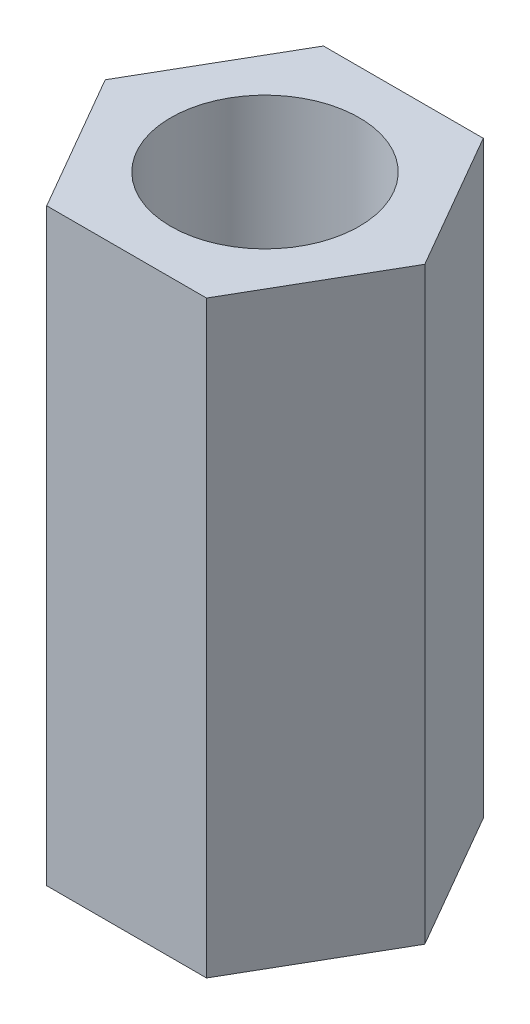
ISO-10303-21;
HEADER;
FILE_DESCRIPTION(('STEP AP214'),'2;1');
FILE_NAME('part.step','',(''),(''),'','','');
FILE_SCHEMA(('AUTOMOTIVE_DESIGN { 1 0 10303 214 1 1 1 1 }'));
ENDSEC;
DATA;
#1=APPLICATION_CONTEXT('core data for automotive mechanical design processes');
#2=APPLICATION_PROTOCOL_DEFINITION('international standard','automotive_design',2000,#1);
#3=PRODUCT_CONTEXT('',#1,'mechanical');
#4=PRODUCT('Part','Part','',(#3));
#5=PRODUCT_RELATED_PRODUCT_CATEGORY('part','',(#4));
#6=PRODUCT_DEFINITION_FORMATION('','',#4);
#7=PRODUCT_DEFINITION_CONTEXT('part definition',#1,'design');
#8=PRODUCT_DEFINITION('design','',#6,#7);
#9=PRODUCT_DEFINITION_SHAPE('','',#8);
#10=(LENGTH_UNIT() NAMED_UNIT(*) SI_UNIT(.MILLI.,.METRE.));
#11=(NAMED_UNIT(*) PLANE_ANGLE_UNIT() SI_UNIT($,.RADIAN.));
#12=(NAMED_UNIT(*) SI_UNIT($,.STERADIAN.) SOLID_ANGLE_UNIT());
#13=UNCERTAINTY_MEASURE_WITH_UNIT(LENGTH_MEASURE(1.E-05),#10,'distance_accuracy_value','');
#14=(GEOMETRIC_REPRESENTATION_CONTEXT(3) GLOBAL_UNCERTAINTY_ASSIGNED_CONTEXT((#13)) GLOBAL_UNIT_ASSIGNED_CONTEXT((#10,
#11,#12)) REPRESENTATION_CONTEXT('',''));
#15=CARTESIAN_POINT('',(0.,0.,0.));
#16=DIRECTION('',(0.,0.,1.));
#17=DIRECTION('',(1.,0.,0.));
#18=AXIS2_PLACEMENT_3D('',#15,#16,#17);
#19=CARTESIAN_POINT('',(1.35677313259562,10.,2.35));
#20=DIRECTION('',(-0.866025403784439,0.,-0.5));
#21=DIRECTION('',(-0.5,0.,0.866025403784439));
#22=AXIS2_PLACEMENT_3D('',#19,#20,#21);
#23=PLANE('',#22);
#24=DIRECTION('',(0.5,0.,-0.866025403784439));
#25=VECTOR('',#24,1.);
#26=CARTESIAN_POINT('',(1.35677313259562,0.,2.35));
#27=LINE('',#26,#25);
#28=CARTESIAN_POINT('',(1.35677313259562,0.,2.35));
#29=VERTEX_POINT('',#28);
#30=CARTESIAN_POINT('',(2.71354626519124,0.,0.));
#31=VERTEX_POINT('',#30);
#32=EDGE_CURVE('E119',#29,#31,#27,.T.);
#33=ORIENTED_EDGE('',*,*,#32,.T.);
#34=DIRECTION('',(0.,-1.,0.));
#35=VECTOR('',#34,1.);
#36=CARTESIAN_POINT('',(2.71354626519124,10.,0.));
#37=LINE('',#36,#35);
#38=CARTESIAN_POINT('',(2.71354626519124,10.,0.));
#39=VERTEX_POINT('',#38);
#40=EDGE_CURVE('E11',#39,#31,#37,.T.);
#41=ORIENTED_EDGE('',*,*,#40,.F.);
#42=DIRECTION('',(0.5,0.,-0.866025403784439));
#43=VECTOR('',#42,1.);
#44=CARTESIAN_POINT('',(1.35677313259562,10.,2.35));
#45=LINE('',#44,#43);
#46=CARTESIAN_POINT('',(1.35677313259562,10.,2.35));
#47=VERTEX_POINT('',#46);
#48=EDGE_CURVE('E130',#47,#39,#45,.T.);
#49=ORIENTED_EDGE('',*,*,#48,.F.);
#50=DIRECTION('',(0.,-1.,0.));
#51=VECTOR('',#50,1.);
#52=CARTESIAN_POINT('',(1.35677313259562,10.,2.35));
#53=LINE('',#52,#51);
#54=EDGE_CURVE('E115',#47,#29,#53,.T.);
#55=ORIENTED_EDGE('',*,*,#54,.T.);
#56=EDGE_LOOP('',(#33,#41,#49,#55));
#57=FACE_BOUND('',#56,.T.);
#58=ADVANCED_FACE('F35',(#57),#23,.F.);
#59=CARTESIAN_POINT('',(2.71354626519124,10.,0.));
#60=DIRECTION('',(-0.866025403784439,0.,0.5));
#61=DIRECTION('',(0.5,0.,0.866025403784439));
#62=AXIS2_PLACEMENT_3D('',#59,#60,#61);
#63=PLANE('',#62);
#64=DIRECTION('',(-0.5,0.,-0.866025403784439));
#65=VECTOR('',#64,1.);
#66=CARTESIAN_POINT('',(2.71354626519124,0.,0.));
#67=LINE('',#66,#65);
#68=CARTESIAN_POINT('',(1.35677313259562,0.,-2.35));
#69=VERTEX_POINT('',#68);
#70=EDGE_CURVE('E122',#31,#69,#67,.T.);
#71=ORIENTED_EDGE('',*,*,#70,.T.);
#72=DIRECTION('',(0.,-1.,0.));
#73=VECTOR('',#72,1.);
#74=CARTESIAN_POINT('',(1.35677313259562,10.,-2.35));
#75=LINE('',#74,#73);
#76=CARTESIAN_POINT('',(1.35677313259562,10.,-2.35));
#77=VERTEX_POINT('',#76);
#78=EDGE_CURVE('E43',#77,#69,#75,.T.);
#79=ORIENTED_EDGE('',*,*,#78,.F.);
#80=DIRECTION('',(-0.5,0.,-0.866025403784439));
#81=VECTOR('',#80,1.);
#82=CARTESIAN_POINT('',(2.71354626519124,10.,0.));
#83=LINE('',#82,#81);
#84=EDGE_CURVE('E88',#39,#77,#83,.T.);
#85=ORIENTED_EDGE('',*,*,#84,.F.);
#86=ORIENTED_EDGE('',*,*,#40,.T.);
#87=EDGE_LOOP('',(#71,#79,#85,#86));
#88=FACE_BOUND('',#87,.T.);
#89=ADVANCED_FACE('F155',(#88),#63,.F.);
#90=CARTESIAN_POINT('',(1.35677313259562,10.,-2.35));
#91=DIRECTION('',(0.,0.,1.));
#92=DIRECTION('',(1.,0.,0.));
#93=AXIS2_PLACEMENT_3D('',#90,#91,#92);
#94=PLANE('',#93);
#95=DIRECTION('',(-1.,0.,0.));
#96=VECTOR('',#95,1.);
#97=CARTESIAN_POINT('',(1.35677313259562,0.,-2.35));
#98=LINE('',#97,#96);
#99=CARTESIAN_POINT('',(-1.35677313259562,0.,-2.35));
#100=VERTEX_POINT('',#99);
#101=EDGE_CURVE('E125',#69,#100,#98,.T.);
#102=ORIENTED_EDGE('',*,*,#101,.T.);
#103=DIRECTION('',(0.,-1.,0.));
#104=VECTOR('',#103,1.);
#105=CARTESIAN_POINT('',(-1.35677313259562,10.,-2.35));
#106=LINE('',#105,#104);
#107=CARTESIAN_POINT('',(-1.35677313259562,10.,-2.35));
#108=VERTEX_POINT('',#107);
#109=EDGE_CURVE('E110',#108,#100,#106,.T.);
#110=ORIENTED_EDGE('',*,*,#109,.F.);
#111=DIRECTION('',(-1.,0.,0.));
#112=VECTOR('',#111,1.);
#113=CARTESIAN_POINT('',(1.35677313259562,10.,-2.35));
#114=LINE('',#113,#112);
#115=EDGE_CURVE('E101',#77,#108,#114,.T.);
#116=ORIENTED_EDGE('',*,*,#115,.F.);
#117=ORIENTED_EDGE('',*,*,#78,.T.);
#118=EDGE_LOOP('',(#102,#110,#116,#117));
#119=FACE_BOUND('',#118,.T.);
#120=ADVANCED_FACE('F136',(#119),#94,.F.);
#121=CARTESIAN_POINT('',(-1.35677313259562,10.,-2.35));
#122=DIRECTION('',(0.866025403784439,0.,0.5));
#123=DIRECTION('',(0.5,0.,-0.866025403784439));
#124=AXIS2_PLACEMENT_3D('',#121,#122,#123);
#125=PLANE('',#124);
#126=DIRECTION('',(-0.5,0.,0.866025403784439));
#127=VECTOR('',#126,1.);
#128=CARTESIAN_POINT('',(-1.35677313259562,0.,-2.35));
#129=LINE('',#128,#127);
#130=CARTESIAN_POINT('',(-2.71354626519124,0.,0.));
#131=VERTEX_POINT('',#130);
#132=EDGE_CURVE('E109',#100,#131,#129,.T.);
#133=ORIENTED_EDGE('',*,*,#132,.T.);
#134=DIRECTION('',(0.,-1.,0.));
#135=VECTOR('',#134,1.);
#136=CARTESIAN_POINT('',(-2.71354626519124,10.,0.));
#137=LINE('',#136,#135);
#138=CARTESIAN_POINT('',(-2.71354626519124,10.,0.));
#139=VERTEX_POINT('',#138);
#140=EDGE_CURVE('E106',#139,#131,#137,.T.);
#141=ORIENTED_EDGE('',*,*,#140,.F.);
#142=DIRECTION('',(-0.5,0.,0.866025403784439));
#143=VECTOR('',#142,1.);
#144=CARTESIAN_POINT('',(-1.35677313259562,10.,-2.35));
#145=LINE('',#144,#143);
#146=EDGE_CURVE('E95',#108,#139,#145,.T.);
#147=ORIENTED_EDGE('',*,*,#146,.F.);
#148=ORIENTED_EDGE('',*,*,#109,.T.);
#149=EDGE_LOOP('',(#133,#141,#147,#148));
#150=FACE_BOUND('',#149,.T.);
#151=ADVANCED_FACE('F107',(#150),#125,.F.);
#152=CARTESIAN_POINT('',(-2.71354626519124,10.,0.));
#153=DIRECTION('',(0.866025403784439,0.,-0.5));
#154=DIRECTION('',(-0.5,0.,-0.866025403784439));
#155=AXIS2_PLACEMENT_3D('',#152,#153,#154);
#156=PLANE('',#155);
#157=DIRECTION('',(0.5,0.,0.866025403784439));
#158=VECTOR('',#157,1.);
#159=CARTESIAN_POINT('',(-2.71354626519124,0.,0.));
#160=LINE('',#159,#158);
#161=CARTESIAN_POINT('',(-1.35677313259562,0.,2.35));
#162=VERTEX_POINT('',#161);
#163=EDGE_CURVE('E74',#131,#162,#160,.T.);
#164=ORIENTED_EDGE('',*,*,#163,.T.);
#165=DIRECTION('',(0.,-1.,0.));
#166=VECTOR('',#165,1.);
#167=CARTESIAN_POINT('',(-1.35677313259562,10.,2.35));
#168=LINE('',#167,#166);
#169=CARTESIAN_POINT('',(-1.35677313259562,10.,2.35));
#170=VERTEX_POINT('',#169);
#171=EDGE_CURVE('E111',#170,#162,#168,.T.);
#172=ORIENTED_EDGE('',*,*,#171,.F.);
#173=DIRECTION('',(0.5,0.,0.866025403784439));
#174=VECTOR('',#173,1.);
#175=CARTESIAN_POINT('',(-2.71354626519124,10.,0.));
#176=LINE('',#175,#174);
#177=EDGE_CURVE('E99',#139,#170,#176,.T.);
#178=ORIENTED_EDGE('',*,*,#177,.F.);
#179=ORIENTED_EDGE('',*,*,#140,.T.);
#180=EDGE_LOOP('',(#164,#172,#178,#179));
#181=FACE_BOUND('',#180,.T.);
#182=ADVANCED_FACE('F113',(#181),#156,.F.);
#183=CARTESIAN_POINT('',(-1.35677313259562,10.,2.35));
#184=DIRECTION('',(0.,0.,-1.));
#185=DIRECTION('',(-1.,0.,0.));
#186=AXIS2_PLACEMENT_3D('',#183,#184,#185);
#187=PLANE('',#186);
#188=DIRECTION('',(1.,0.,0.));
#189=VECTOR('',#188,1.);
#190=CARTESIAN_POINT('',(-1.35677313259562,0.,2.35));
#191=LINE('',#190,#189);
#192=EDGE_CURVE('E80',#162,#29,#191,.T.);
#193=ORIENTED_EDGE('',*,*,#192,.T.);
#194=ORIENTED_EDGE('',*,*,#54,.F.);
#195=DIRECTION('',(1.,0.,0.));
#196=VECTOR('',#195,1.);
#197=CARTESIAN_POINT('',(-1.35677313259562,10.,2.35));
#198=LINE('',#197,#196);
#199=EDGE_CURVE('E51',#170,#47,#198,.T.);
#200=ORIENTED_EDGE('',*,*,#199,.F.);
#201=ORIENTED_EDGE('',*,*,#171,.T.);
#202=EDGE_LOOP('',(#193,#194,#200,#201));
#203=FACE_BOUND('',#202,.T.);
#204=ADVANCED_FACE('F143',(#203),#187,.F.);
#205=CARTESIAN_POINT('',(0.,10.,0.));
#206=DIRECTION('',(0.,1.,0.));
#207=DIRECTION('',(0.,0.,1.));
#208=AXIS2_PLACEMENT_3D('',#205,#206,#207);
#209=PLANE('',#208);
#210=CARTESIAN_POINT('',(0.,10.,0.));
#211=DIRECTION('',(0.,1.,0.));
#212=DIRECTION('',(0.,0.,1.));
#213=AXIS2_PLACEMENT_3D('',#210,#211,#212);
#214=CIRCLE('',#213,1.6);
#215=CARTESIAN_POINT('',(0.,10.,1.6));
#216=VERTEX_POINT('',#215);
#217=EDGE_CURVE('E210',#216,#216,#214,.T.);
#218=ORIENTED_EDGE('',*,*,#217,.F.);
#219=EDGE_LOOP('',(#218));
#220=FACE_BOUND('',#219,.T.);
#221=ORIENTED_EDGE('',*,*,#48,.T.);
#222=ORIENTED_EDGE('',*,*,#84,.T.);
#223=ORIENTED_EDGE('',*,*,#115,.T.);
#224=ORIENTED_EDGE('',*,*,#146,.T.);
#225=ORIENTED_EDGE('',*,*,#177,.T.);
#226=ORIENTED_EDGE('',*,*,#199,.T.);
#227=EDGE_LOOP('',(#221,#222,#223,#224,#225,#226));
#228=FACE_BOUND('',#227,.T.);
#229=ADVANCED_FACE('F97',(#220,#228),#209,.T.);
#230=CARTESIAN_POINT('',(0.,0.,0.));
#231=DIRECTION('',(0.,1.,0.));
#232=DIRECTION('',(0.,0.,1.));
#233=AXIS2_PLACEMENT_3D('',#230,#231,#232);
#234=PLANE('',#233);
#235=CARTESIAN_POINT('',(0.,0.,0.));
#236=DIRECTION('',(0.,1.,0.));
#237=DIRECTION('',(0.,0.,1.));
#238=AXIS2_PLACEMENT_3D('',#235,#236,#237);
#239=CIRCLE('',#238,1.6);
#240=CARTESIAN_POINT('',(0.,0.,1.6));
#241=VERTEX_POINT('',#240);
#242=EDGE_CURVE('E123',#241,#241,#239,.T.);
#243=ORIENTED_EDGE('',*,*,#242,.T.);
#244=EDGE_LOOP('',(#243));
#245=FACE_BOUND('',#244,.T.);
#246=ORIENTED_EDGE('',*,*,#32,.F.);
#247=ORIENTED_EDGE('',*,*,#192,.F.);
#248=ORIENTED_EDGE('',*,*,#163,.F.);
#249=ORIENTED_EDGE('',*,*,#132,.F.);
#250=ORIENTED_EDGE('',*,*,#101,.F.);
#251=ORIENTED_EDGE('',*,*,#70,.F.);
#252=EDGE_LOOP('',(#246,#247,#248,#249,#250,#251));
#253=FACE_BOUND('',#252,.T.);
#254=ADVANCED_FACE('F139',(#245,#253),#234,.F.);
#255=CARTESIAN_POINT('',(0.,0.,0.));
#256=DIRECTION('',(0.,1.,0.));
#257=DIRECTION('',(0.,0.,1.));
#258=AXIS2_PLACEMENT_3D('',#255,#256,#257);
#259=CYLINDRICAL_SURFACE('',#258,1.6);
#260=ORIENTED_EDGE('',*,*,#242,.F.);
#261=EDGE_LOOP('',(#260));
#262=FACE_BOUND('',#261,.T.);
#263=ORIENTED_EDGE('',*,*,#217,.T.);
#264=EDGE_LOOP('',(#263));
#265=FACE_BOUND('',#264,.T.);
#266=ADVANCED_FACE('F192',(#262,#265),#259,.F.);
#267=CLOSED_SHELL('',(#58,#89,#120,#151,#182,#204,#229,#254,#266));
#268=MANIFOLD_SOLID_BREP('B2',#267);
#269=ADVANCED_BREP_SHAPE_REPRESENTATION('',(#18,#268),#14);
#270=SHAPE_DEFINITION_REPRESENTATION(#9,#269);
ENDSEC;
END-ISO-10303-21;
